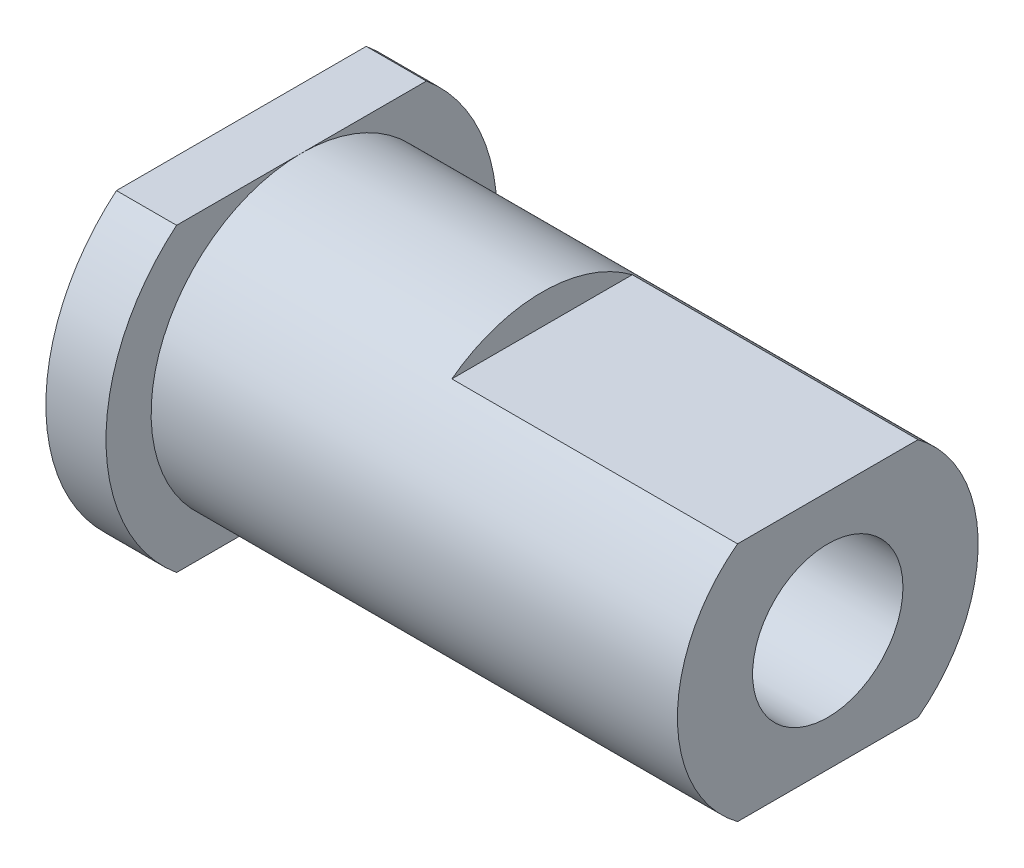
ISO-10303-21;
HEADER;
FILE_DESCRIPTION(('STEP AP214'),'2;1');
FILE_NAME('part.step','',(''),(''),'','','');
FILE_SCHEMA(('AUTOMOTIVE_DESIGN { 1 0 10303 214 1 1 1 1 }'));
ENDSEC;
DATA;
#1=APPLICATION_CONTEXT('core data for automotive mechanical design processes');
#2=APPLICATION_PROTOCOL_DEFINITION('international standard','automotive_design',2000,#1);
#3=PRODUCT_CONTEXT('',#1,'mechanical');
#4=PRODUCT('Part','Part','',(#3));
#5=PRODUCT_RELATED_PRODUCT_CATEGORY('part','',(#4));
#6=PRODUCT_DEFINITION_FORMATION('','',#4);
#7=PRODUCT_DEFINITION_CONTEXT('part definition',#1,'design');
#8=PRODUCT_DEFINITION('design','',#6,#7);
#9=PRODUCT_DEFINITION_SHAPE('','',#8);
#10=(LENGTH_UNIT() NAMED_UNIT(*) SI_UNIT(.MILLI.,.METRE.));
#11=(NAMED_UNIT(*) PLANE_ANGLE_UNIT() SI_UNIT($,.RADIAN.));
#12=(NAMED_UNIT(*) SI_UNIT($,.STERADIAN.) SOLID_ANGLE_UNIT());
#13=UNCERTAINTY_MEASURE_WITH_UNIT(LENGTH_MEASURE(1.E-05),#10,'distance_accuracy_value','');
#14=(GEOMETRIC_REPRESENTATION_CONTEXT(3) GLOBAL_UNCERTAINTY_ASSIGNED_CONTEXT((#13)) GLOBAL_UNIT_ASSIGNED_CONTEXT((#10,
#11,#12)) REPRESENTATION_CONTEXT('',''));
#15=CARTESIAN_POINT('',(0.,0.,0.));
#16=DIRECTION('',(0.,0.,1.));
#17=DIRECTION('',(1.,0.,0.));
#18=AXIS2_PLACEMENT_3D('',#15,#16,#17);
#19=CARTESIAN_POINT('',(10.,0.,0.));
#20=DIRECTION('',(1.,0.,0.));
#21=DIRECTION('',(0.,0.,-1.));
#22=AXIS2_PLACEMENT_3D('',#19,#20,#21);
#23=PLANE('',#22);
#24=CARTESIAN_POINT('',(10.,0.,0.));
#25=DIRECTION('',(1.,0.,0.));
#26=DIRECTION('',(0.,0.,-1.));
#27=AXIS2_PLACEMENT_3D('',#24,#25,#26);
#28=CIRCLE('',#27,5.);
#29=CARTESIAN_POINT('',(10.,4.,-3.));
#30=VERTEX_POINT('',#29);
#31=CARTESIAN_POINT('',(10.,4.,3.));
#32=VERTEX_POINT('',#31);
#33=EDGE_CURVE('E60',#30,#32,#28,.T.);
#34=ORIENTED_EDGE('',*,*,#33,.T.);
#35=DIRECTION('',(0.,0.,-1.));
#36=VECTOR('',#35,1.);
#37=CARTESIAN_POINT('',(10.,4.,0.));
#38=LINE('',#37,#36);
#39=EDGE_CURVE('E128',#32,#30,#38,.T.);
#40=ORIENTED_EDGE('',*,*,#39,.T.);
#41=EDGE_LOOP('',(#34,#40));
#42=FACE_BOUND('',#41,.T.);
#43=ADVANCED_FACE('F36',(#42),#23,.T.);
#44=CARTESIAN_POINT('',(2.,0.,0.));
#45=DIRECTION('',(1.,0.,0.));
#46=DIRECTION('',(0.,0.,-1.));
#47=AXIS2_PLACEMENT_3D('',#44,#45,#46);
#48=PLANE('',#47);
#49=CARTESIAN_POINT('',(2.,0.,0.));
#50=DIRECTION('',(1.,0.,0.));
#51=DIRECTION('',(0.,0.,-1.));
#52=AXIS2_PLACEMENT_3D('',#49,#50,#51);
#53=CIRCLE('',#52,5.);
#54=CARTESIAN_POINT('',(2.,5.,0.));
#55=VERTEX_POINT('',#54);
#56=CARTESIAN_POINT('',(2.,-5.,0.));
#57=VERTEX_POINT('',#56);
#58=EDGE_CURVE('E47',#55,#57,#53,.T.);
#59=ORIENTED_EDGE('',*,*,#58,.F.);
#60=DIRECTION('',(0.,0.,-1.));
#61=VECTOR('',#60,1.);
#62=CARTESIAN_POINT('',(2.,5.,0.));
#63=LINE('',#62,#61);
#64=CARTESIAN_POINT('',(2.,5.,4.15331193145904));
#65=VERTEX_POINT('',#64);
#66=EDGE_CURVE('E164',#65,#55,#63,.T.);
#67=ORIENTED_EDGE('',*,*,#66,.F.);
#68=CARTESIAN_POINT('',(2.,0.,0.));
#69=DIRECTION('',(1.,0.,0.));
#70=DIRECTION('',(0.,0.,-1.));
#71=AXIS2_PLACEMENT_3D('',#68,#69,#70);
#72=CIRCLE('',#71,6.5);
#73=CARTESIAN_POINT('',(2.,-5.,4.15331193145904));
#74=VERTEX_POINT('',#73);
#75=EDGE_CURVE('E152',#65,#74,#72,.T.);
#76=ORIENTED_EDGE('',*,*,#75,.T.);
#77=DIRECTION('',(0.,0.,-1.));
#78=VECTOR('',#77,1.);
#79=CARTESIAN_POINT('',(2.,-5.,0.));
#80=LINE('',#79,#78);
#81=EDGE_CURVE('E157',#74,#57,#80,.T.);
#82=ORIENTED_EDGE('',*,*,#81,.T.);
#83=EDGE_LOOP('',(#59,#67,#76,#82));
#84=FACE_BOUND('',#83,.T.);
#85=ADVANCED_FACE('F205',(#84),#48,.T.);
#86=CARTESIAN_POINT('',(2.,0.,0.));
#87=DIRECTION('',(-1.,0.,0.));
#88=DIRECTION('',(0.,0.,1.));
#89=AXIS2_PLACEMENT_3D('',#86,#87,#88);
#90=CYLINDRICAL_SURFACE('',#89,6.5);
#91=CARTESIAN_POINT('',(0.,0.,0.));
#92=DIRECTION('',(1.,0.,0.));
#93=DIRECTION('',(0.,0.,-1.));
#94=AXIS2_PLACEMENT_3D('',#91,#92,#93);
#95=CIRCLE('',#94,6.5);
#96=CARTESIAN_POINT('',(0.,5.,4.15331193145904));
#97=VERTEX_POINT('',#96);
#98=CARTESIAN_POINT('',(0.,-5.,4.15331193145904));
#99=VERTEX_POINT('',#98);
#100=EDGE_CURVE('E167',#97,#99,#95,.T.);
#101=ORIENTED_EDGE('',*,*,#100,.T.);
#102=DIRECTION('',(-1.,0.,0.));
#103=VECTOR('',#102,1.);
#104=CARTESIAN_POINT('',(2.,-5.,4.15331193145904));
#105=LINE('',#104,#103);
#106=EDGE_CURVE('E45',#74,#99,#105,.T.);
#107=ORIENTED_EDGE('',*,*,#106,.F.);
#108=ORIENTED_EDGE('',*,*,#75,.F.);
#109=DIRECTION('',(-1.,0.,0.));
#110=VECTOR('',#109,1.);
#111=CARTESIAN_POINT('',(2.,5.,4.15331193145904));
#112=LINE('',#111,#110);
#113=EDGE_CURVE('E166',#65,#97,#112,.T.);
#114=ORIENTED_EDGE('',*,*,#113,.T.);
#115=EDGE_LOOP('',(#101,#107,#108,#114));
#116=FACE_BOUND('',#115,.T.);
#117=ADVANCED_FACE('F38',(#116),#90,.T.);
#118=CARTESIAN_POINT('',(2.,-5.,0.));
#119=DIRECTION('',(0.,1.,0.));
#120=DIRECTION('',(0.,0.,1.));
#121=AXIS2_PLACEMENT_3D('',#118,#119,#120);
#122=PLANE('',#121);
#123=DIRECTION('',(0.,0.,-1.));
#124=VECTOR('',#123,1.);
#125=CARTESIAN_POINT('',(0.,-5.,0.));
#126=LINE('',#125,#124);
#127=CARTESIAN_POINT('',(0.,-5.,-4.15331193145904));
#128=VERTEX_POINT('',#127);
#129=EDGE_CURVE('E170',#99,#128,#126,.T.);
#130=ORIENTED_EDGE('',*,*,#129,.T.);
#131=DIRECTION('',(-1.,0.,0.));
#132=VECTOR('',#131,1.);
#133=CARTESIAN_POINT('',(2.,-5.,-4.15331193145904));
#134=LINE('',#133,#132);
#135=CARTESIAN_POINT('',(2.,-5.,-4.15331193145904));
#136=VERTEX_POINT('',#135);
#137=EDGE_CURVE('E180',#136,#128,#134,.T.);
#138=ORIENTED_EDGE('',*,*,#137,.F.);
#139=EDGE_CURVE('E155',#57,#136,#80,.T.);
#140=ORIENTED_EDGE('',*,*,#139,.F.);
#141=ORIENTED_EDGE('',*,*,#81,.F.);
#142=ORIENTED_EDGE('',*,*,#106,.T.);
#143=EDGE_LOOP('',(#130,#138,#140,#141,#142));
#144=FACE_BOUND('',#143,.T.);
#145=ADVANCED_FACE('F235',(#144),#122,.F.);
#146=CARTESIAN_POINT('',(2.,0.,0.));
#147=DIRECTION('',(-1.,0.,0.));
#148=DIRECTION('',(0.,0.,1.));
#149=AXIS2_PLACEMENT_3D('',#146,#147,#148);
#150=CYLINDRICAL_SURFACE('',#149,6.5);
#151=CARTESIAN_POINT('',(0.,0.,0.));
#152=DIRECTION('',(1.,0.,0.));
#153=DIRECTION('',(0.,0.,-1.));
#154=AXIS2_PLACEMENT_3D('',#151,#152,#153);
#155=CIRCLE('',#154,6.5);
#156=CARTESIAN_POINT('',(0.,5.,-4.15331193145904));
#157=VERTEX_POINT('',#156);
#158=EDGE_CURVE('E172',#128,#157,#155,.T.);
#159=ORIENTED_EDGE('',*,*,#158,.T.);
#160=DIRECTION('',(-1.,0.,0.));
#161=VECTOR('',#160,1.);
#162=CARTESIAN_POINT('',(2.,5.,-4.15331193145904));
#163=LINE('',#162,#161);
#164=CARTESIAN_POINT('',(2.,5.,-4.15331193145904));
#165=VERTEX_POINT('',#164);
#166=EDGE_CURVE('E178',#165,#157,#163,.T.);
#167=ORIENTED_EDGE('',*,*,#166,.F.);
#168=CARTESIAN_POINT('',(2.,0.,0.));
#169=DIRECTION('',(1.,0.,0.));
#170=DIRECTION('',(0.,0.,-1.));
#171=AXIS2_PLACEMENT_3D('',#168,#169,#170);
#172=CIRCLE('',#171,6.5);
#173=EDGE_CURVE('E160',#136,#165,#172,.T.);
#174=ORIENTED_EDGE('',*,*,#173,.F.);
#175=ORIENTED_EDGE('',*,*,#137,.T.);
#176=EDGE_LOOP('',(#159,#167,#174,#175));
#177=FACE_BOUND('',#176,.T.);
#178=ADVANCED_FACE('F232',(#177),#150,.T.);
#179=CARTESIAN_POINT('',(2.,5.,0.));
#180=DIRECTION('',(0.,1.,0.));
#181=DIRECTION('',(0.,0.,1.));
#182=AXIS2_PLACEMENT_3D('',#179,#180,#181);
#183=PLANE('',#182);
#184=DIRECTION('',(0.,0.,-1.));
#185=VECTOR('',#184,1.);
#186=CARTESIAN_POINT('',(0.,5.,0.));
#187=LINE('',#186,#185);
#188=EDGE_CURVE('E156',#97,#157,#187,.T.);
#189=ORIENTED_EDGE('',*,*,#188,.F.);
#190=ORIENTED_EDGE('',*,*,#113,.F.);
#191=ORIENTED_EDGE('',*,*,#66,.T.);
#192=EDGE_CURVE('E163',#55,#165,#63,.T.);
#193=ORIENTED_EDGE('',*,*,#192,.T.);
#194=ORIENTED_EDGE('',*,*,#166,.T.);
#195=EDGE_LOOP('',(#189,#190,#191,#193,#194));
#196=FACE_BOUND('',#195,.T.);
#197=ADVANCED_FACE('F227',(#196),#183,.T.);
#198=EDGE_CURVE('E11',#57,#55,#53,.T.);
#199=ORIENTED_EDGE('',*,*,#198,.F.);
#200=ORIENTED_EDGE('',*,*,#139,.T.);
#201=ORIENTED_EDGE('',*,*,#173,.T.);
#202=ORIENTED_EDGE('',*,*,#192,.F.);
#203=EDGE_LOOP('',(#199,#200,#201,#202));
#204=FACE_BOUND('',#203,.T.);
#205=ADVANCED_FACE('F213',(#204),#48,.T.);
#206=CARTESIAN_POINT('',(0.,0.,0.));
#207=DIRECTION('',(1.,0.,0.));
#208=DIRECTION('',(0.,0.,-1.));
#209=AXIS2_PLACEMENT_3D('',#206,#207,#208);
#210=PLANE('',#209);
#211=CARTESIAN_POINT('',(0.,0.,0.));
#212=DIRECTION('',(1.,0.,0.));
#213=DIRECTION('',(0.,0.,-1.));
#214=AXIS2_PLACEMENT_3D('',#211,#212,#213);
#215=CIRCLE('',#214,2.5);
#216=CARTESIAN_POINT('',(0.,0.,-2.5));
#217=VERTEX_POINT('',#216);
#218=EDGE_CURVE('E190',#217,#217,#215,.T.);
#219=ORIENTED_EDGE('',*,*,#218,.T.);
#220=EDGE_LOOP('',(#219));
#221=FACE_BOUND('',#220,.T.);
#222=ORIENTED_EDGE('',*,*,#100,.F.);
#223=ORIENTED_EDGE('',*,*,#188,.T.);
#224=ORIENTED_EDGE('',*,*,#158,.F.);
#225=ORIENTED_EDGE('',*,*,#129,.F.);
#226=EDGE_LOOP('',(#222,#223,#224,#225));
#227=FACE_BOUND('',#226,.T.);
#228=ADVANCED_FACE('F221',(#221,#227),#210,.F.);
#229=CARTESIAN_POINT('',(10.,0.,0.));
#230=DIRECTION('',(-1.,0.,0.));
#231=DIRECTION('',(0.,0.,1.));
#232=AXIS2_PLACEMENT_3D('',#229,#230,#231);
#233=CYLINDRICAL_SURFACE('',#232,5.);
#234=ORIENTED_EDGE('',*,*,#33,.F.);
#235=DIRECTION('',(-1.,0.,0.));
#236=VECTOR('',#235,1.);
#237=CARTESIAN_POINT('',(19.5,4.,-3.));
#238=LINE('',#237,#236);
#239=CARTESIAN_POINT('',(19.5,4.,-3.));
#240=VERTEX_POINT('',#239);
#241=EDGE_CURVE('E135',#240,#30,#238,.T.);
#242=ORIENTED_EDGE('',*,*,#241,.F.);
#243=CARTESIAN_POINT('',(19.5,0.,0.));
#244=DIRECTION('',(1.,0.,0.));
#245=DIRECTION('',(0.,0.,-1.));
#246=AXIS2_PLACEMENT_3D('',#243,#244,#245);
#247=CIRCLE('',#246,5.);
#248=CARTESIAN_POINT('',(19.5,-4.,-3.));
#249=VERTEX_POINT('',#248);
#250=EDGE_CURVE('E119',#249,#240,#247,.T.);
#251=ORIENTED_EDGE('',*,*,#250,.F.);
#252=DIRECTION('',(-1.,0.,0.));
#253=VECTOR('',#252,1.);
#254=CARTESIAN_POINT('',(19.5,-4.,-3.));
#255=LINE('',#254,#253);
#256=CARTESIAN_POINT('',(10.,-4.,-3.));
#257=VERTEX_POINT('',#256);
#258=EDGE_CURVE('E116',#249,#257,#255,.T.);
#259=ORIENTED_EDGE('',*,*,#258,.T.);
#260=CARTESIAN_POINT('',(10.,-4.,3.));
#261=VERTEX_POINT('',#260);
#262=EDGE_CURVE('E132',#261,#257,#28,.T.);
#263=ORIENTED_EDGE('',*,*,#262,.F.);
#264=DIRECTION('',(-1.,0.,0.));
#265=VECTOR('',#264,1.);
#266=CARTESIAN_POINT('',(19.5,-4.,3.));
#267=LINE('',#266,#265);
#268=CARTESIAN_POINT('',(19.5,-4.,3.));
#269=VERTEX_POINT('',#268);
#270=EDGE_CURVE('E114',#269,#261,#267,.T.);
#271=ORIENTED_EDGE('',*,*,#270,.F.);
#272=CARTESIAN_POINT('',(19.5,0.,0.));
#273=DIRECTION('',(1.,0.,0.));
#274=DIRECTION('',(0.,0.,-1.));
#275=AXIS2_PLACEMENT_3D('',#272,#273,#274);
#276=CIRCLE('',#275,5.);
#277=CARTESIAN_POINT('',(19.5,4.,3.));
#278=VERTEX_POINT('',#277);
#279=EDGE_CURVE('E120',#278,#269,#276,.T.);
#280=ORIENTED_EDGE('',*,*,#279,.F.);
#281=DIRECTION('',(-1.,0.,0.));
#282=VECTOR('',#281,1.);
#283=CARTESIAN_POINT('',(19.5,4.,3.));
#284=LINE('',#283,#282);
#285=EDGE_CURVE('E142',#278,#32,#284,.T.);
#286=ORIENTED_EDGE('',*,*,#285,.T.);
#287=EDGE_LOOP('',(#234,#242,#251,#259,#263,#271,#280,#286));
#288=FACE_BOUND('',#287,.T.);
#289=ORIENTED_EDGE('',*,*,#58,.T.);
#290=ORIENTED_EDGE('',*,*,#198,.T.);
#291=EDGE_LOOP('',(#289,#290));
#292=FACE_BOUND('',#291,.T.);
#293=ADVANCED_FACE('F130',(#288,#292),#233,.T.);
#294=DIRECTION('',(0.,0.,-1.));
#295=VECTOR('',#294,1.);
#296=CARTESIAN_POINT('',(10.,-4.,0.));
#297=LINE('',#296,#295);
#298=EDGE_CURVE('E53',#261,#257,#297,.T.);
#299=ORIENTED_EDGE('',*,*,#298,.F.);
#300=ORIENTED_EDGE('',*,*,#262,.T.);
#301=EDGE_LOOP('',(#299,#300));
#302=FACE_BOUND('',#301,.T.);
#303=ADVANCED_FACE('F207',(#302),#23,.T.);
#304=CARTESIAN_POINT('',(19.5,-4.,0.));
#305=DIRECTION('',(0.,1.,0.));
#306=DIRECTION('',(0.,0.,1.));
#307=AXIS2_PLACEMENT_3D('',#304,#305,#306);
#308=PLANE('',#307);
#309=ORIENTED_EDGE('',*,*,#298,.T.);
#310=ORIENTED_EDGE('',*,*,#258,.F.);
#311=DIRECTION('',(0.,0.,-1.));
#312=VECTOR('',#311,1.);
#313=CARTESIAN_POINT('',(19.5,-4.,0.));
#314=LINE('',#313,#312);
#315=EDGE_CURVE('E110',#269,#249,#314,.T.);
#316=ORIENTED_EDGE('',*,*,#315,.F.);
#317=ORIENTED_EDGE('',*,*,#270,.T.);
#318=EDGE_LOOP('',(#309,#310,#316,#317));
#319=FACE_BOUND('',#318,.T.);
#320=ADVANCED_FACE('F112',(#319),#308,.F.);
#321=CARTESIAN_POINT('',(19.5,4.,0.));
#322=DIRECTION('',(0.,1.,0.));
#323=DIRECTION('',(0.,0.,1.));
#324=AXIS2_PLACEMENT_3D('',#321,#322,#323);
#325=PLANE('',#324);
#326=ORIENTED_EDGE('',*,*,#39,.F.);
#327=ORIENTED_EDGE('',*,*,#285,.F.);
#328=DIRECTION('',(0.,0.,-1.));
#329=VECTOR('',#328,1.);
#330=CARTESIAN_POINT('',(19.5,4.,0.));
#331=LINE('',#330,#329);
#332=EDGE_CURVE('E126',#278,#240,#331,.T.);
#333=ORIENTED_EDGE('',*,*,#332,.T.);
#334=ORIENTED_EDGE('',*,*,#241,.T.);
#335=EDGE_LOOP('',(#326,#327,#333,#334));
#336=FACE_BOUND('',#335,.T.);
#337=ADVANCED_FACE('F202',(#336),#325,.T.);
#338=CARTESIAN_POINT('',(19.5,0.,0.));
#339=DIRECTION('',(1.,0.,0.));
#340=DIRECTION('',(0.,0.,-1.));
#341=AXIS2_PLACEMENT_3D('',#338,#339,#340);
#342=PLANE('',#341);
#343=CARTESIAN_POINT('',(19.5,0.,0.));
#344=DIRECTION('',(1.,0.,0.));
#345=DIRECTION('',(0.,0.,-1.));
#346=AXIS2_PLACEMENT_3D('',#343,#344,#345);
#347=CIRCLE('',#346,2.5);
#348=CARTESIAN_POINT('',(19.5,0.,-2.5));
#349=VERTEX_POINT('',#348);
#350=EDGE_CURVE('E192',#349,#349,#347,.T.);
#351=ORIENTED_EDGE('',*,*,#350,.F.);
#352=EDGE_LOOP('',(#351));
#353=FACE_BOUND('',#352,.T.);
#354=ORIENTED_EDGE('',*,*,#279,.T.);
#355=ORIENTED_EDGE('',*,*,#315,.T.);
#356=ORIENTED_EDGE('',*,*,#250,.T.);
#357=ORIENTED_EDGE('',*,*,#332,.F.);
#358=EDGE_LOOP('',(#354,#355,#356,#357));
#359=FACE_BOUND('',#358,.T.);
#360=ADVANCED_FACE('F124',(#353,#359),#342,.T.);
#361=CARTESIAN_POINT('',(0.,0.,0.));
#362=DIRECTION('',(1.,0.,0.));
#363=DIRECTION('',(0.,0.,-1.));
#364=AXIS2_PLACEMENT_3D('',#361,#362,#363);
#365=CYLINDRICAL_SURFACE('',#364,2.5);
#366=ORIENTED_EDGE('',*,*,#218,.F.);
#367=EDGE_LOOP('',(#366));
#368=FACE_BOUND('',#367,.T.);
#369=ORIENTED_EDGE('',*,*,#350,.T.);
#370=EDGE_LOOP('',(#369));
#371=FACE_BOUND('',#370,.T.);
#372=ADVANCED_FACE('F332',(#368,#371),#365,.F.);
#373=CLOSED_SHELL('',(#43,#85,#117,#145,#178,#197,#205,#228,#293,#303,#320,#337,#360,#372));
#374=MANIFOLD_SOLID_BREP('B2',#373);
#375=ADVANCED_BREP_SHAPE_REPRESENTATION('',(#18,#374),#14);
#376=SHAPE_DEFINITION_REPRESENTATION(#9,#375);
ENDSEC;
END-ISO-10303-21;
